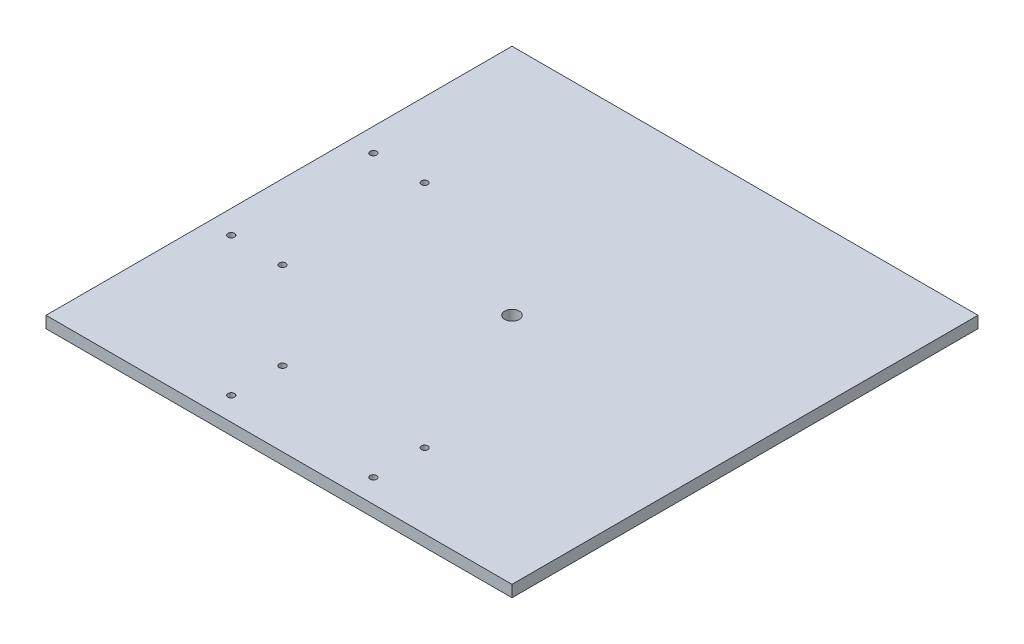
ISO-10303-21;
HEADER;
FILE_DESCRIPTION(('STEP AP214'),'2;1');
FILE_NAME('part.step','',(''),(''),'','','');
FILE_SCHEMA(('AUTOMOTIVE_DESIGN { 1 0 10303 214 1 1 1 1 }'));
ENDSEC;
DATA;
#1=APPLICATION_CONTEXT('core data for automotive mechanical design processes');
#2=APPLICATION_PROTOCOL_DEFINITION('international standard','automotive_design',2000,#1);
#3=PRODUCT_CONTEXT('',#1,'mechanical');
#4=PRODUCT('Part','Part','',(#3));
#5=PRODUCT_RELATED_PRODUCT_CATEGORY('part','',(#4));
#6=PRODUCT_DEFINITION_FORMATION('','',#4);
#7=PRODUCT_DEFINITION_CONTEXT('part definition',#1,'design');
#8=PRODUCT_DEFINITION('design','',#6,#7);
#9=PRODUCT_DEFINITION_SHAPE('','',#8);
#10=(LENGTH_UNIT() NAMED_UNIT(*) SI_UNIT(.MILLI.,.METRE.));
#11=(NAMED_UNIT(*) PLANE_ANGLE_UNIT() SI_UNIT($,.RADIAN.));
#12=(NAMED_UNIT(*) SI_UNIT($,.STERADIAN.) SOLID_ANGLE_UNIT());
#13=UNCERTAINTY_MEASURE_WITH_UNIT(LENGTH_MEASURE(1.E-05),#10,'distance_accuracy_value','');
#14=(GEOMETRIC_REPRESENTATION_CONTEXT(3) GLOBAL_UNCERTAINTY_ASSIGNED_CONTEXT((#13)) GLOBAL_UNIT_ASSIGNED_CONTEXT((#10,
#11,#12)) REPRESENTATION_CONTEXT('',''));
#15=CARTESIAN_POINT('',(0.,0.,0.));
#16=DIRECTION('',(0.,0.,1.));
#17=DIRECTION('',(1.,0.,0.));
#18=AXIS2_PLACEMENT_3D('',#15,#16,#17);
#19=CARTESIAN_POINT('',(0.,12.7,0.));
#20=DIRECTION('',(0.,-1.,0.));
#21=DIRECTION('',(0.,0.,-1.));
#22=AXIS2_PLACEMENT_3D('',#19,#20,#21);
#23=PLANE('',#22);
#24=CARTESIAN_POINT('',(0.,12.7,0.));
#25=DIRECTION('',(0.,1.,0.));
#26=DIRECTION('',(0.,0.,1.));
#27=AXIS2_PLACEMENT_3D('',#24,#25,#26);
#28=CIRCLE('',#27,7.9375);
#29=CARTESIAN_POINT('',(0.,12.7,7.9375));
#30=VERTEX_POINT('',#29);
#31=EDGE_CURVE('E160',#30,#30,#28,.T.);
#32=ORIENTED_EDGE('',*,*,#31,.F.);
#33=EDGE_LOOP('',(#32));
#34=FACE_BOUND('',#33,.T.);
#35=CARTESIAN_POINT('',(-77.47,12.7,228.6));
#36=DIRECTION('',(0.,1.,0.));
#37=DIRECTION('',(0.,0.,1.));
#38=AXIS2_PLACEMENT_3D('',#35,#36,#37);
#39=CIRCLE('',#38,3.56869999999998);
#40=CARTESIAN_POINT('',(-77.47,12.7,232.1687));
#41=VERTEX_POINT('',#40);
#42=EDGE_CURVE('E154',#41,#41,#39,.T.);
#43=ORIENTED_EDGE('',*,*,#42,.F.);
#44=EDGE_LOOP('',(#43));
#45=FACE_BOUND('',#44,.T.);
#46=CARTESIAN_POINT('',(-77.47,12.7,172.72));
#47=DIRECTION('',(0.,1.,0.));
#48=DIRECTION('',(0.,0.,1.));
#49=AXIS2_PLACEMENT_3D('',#46,#47,#48);
#50=CIRCLE('',#49,3.56869999999998);
#51=CARTESIAN_POINT('',(-77.47,12.7,176.2887));
#52=VERTEX_POINT('',#51);
#53=EDGE_CURVE('E148',#52,#52,#50,.T.);
#54=ORIENTED_EDGE('',*,*,#53,.F.);
#55=EDGE_LOOP('',(#54));
#56=FACE_BOUND('',#55,.T.);
#57=CARTESIAN_POINT('',(77.47,12.7,172.72));
#58=DIRECTION('',(0.,1.,0.));
#59=DIRECTION('',(0.,0.,1.));
#60=AXIS2_PLACEMENT_3D('',#57,#58,#59);
#61=CIRCLE('',#60,3.56869999999998);
#62=CARTESIAN_POINT('',(77.47,12.7,176.2887));
#63=VERTEX_POINT('',#62);
#64=EDGE_CURVE('E142',#63,#63,#61,.T.);
#65=ORIENTED_EDGE('',*,*,#64,.F.);
#66=EDGE_LOOP('',(#65));
#67=FACE_BOUND('',#66,.T.);
#68=CARTESIAN_POINT('',(-172.72,12.7,-77.47));
#69=DIRECTION('',(0.,1.,0.));
#70=DIRECTION('',(0.,0.,1.));
#71=AXIS2_PLACEMENT_3D('',#68,#69,#70);
#72=CIRCLE('',#71,3.56869999999998);
#73=CARTESIAN_POINT('',(-172.72,12.7,-73.9013));
#74=VERTEX_POINT('',#73);
#75=EDGE_CURVE('E118',#74,#74,#72,.T.);
#76=ORIENTED_EDGE('',*,*,#75,.F.);
#77=EDGE_LOOP('',(#76));
#78=FACE_BOUND('',#77,.T.);
#79=CARTESIAN_POINT('',(-228.6,12.7,-77.47));
#80=DIRECTION('',(0.,1.,0.));
#81=DIRECTION('',(0.,0.,1.));
#82=AXIS2_PLACEMENT_3D('',#79,#80,#81);
#83=CIRCLE('',#82,3.56869999999998);
#84=CARTESIAN_POINT('',(-228.6,12.7,-73.9013));
#85=VERTEX_POINT('',#84);
#86=EDGE_CURVE('E112',#85,#85,#83,.T.);
#87=ORIENTED_EDGE('',*,*,#86,.F.);
#88=EDGE_LOOP('',(#87));
#89=FACE_BOUND('',#88,.T.);
#90=DIRECTION('',(0.,0.,-1.));
#91=VECTOR('',#90,1.);
#92=CARTESIAN_POINT('',(254.,12.7,254.));
#93=LINE('',#92,#91);
#94=CARTESIAN_POINT('',(254.,12.7,254.));
#95=VERTEX_POINT('',#94);
#96=CARTESIAN_POINT('',(254.,12.7,-254.));
#97=VERTEX_POINT('',#96);
#98=EDGE_CURVE('E84',#95,#97,#93,.T.);
#99=ORIENTED_EDGE('',*,*,#98,.T.);
#100=DIRECTION('',(-1.,0.,0.));
#101=VECTOR('',#100,1.);
#102=CARTESIAN_POINT('',(-254.,12.7,-254.));
#103=LINE('',#102,#101);
#104=CARTESIAN_POINT('',(-254.,12.7,-254.));
#105=VERTEX_POINT('',#104);
#106=EDGE_CURVE('E79',#97,#105,#103,.T.);
#107=ORIENTED_EDGE('',*,*,#106,.T.);
#108=DIRECTION('',(0.,0.,1.));
#109=VECTOR('',#108,1.);
#110=CARTESIAN_POINT('',(-254.,12.7,254.));
#111=LINE('',#110,#109);
#112=CARTESIAN_POINT('',(-254.,12.7,254.));
#113=VERTEX_POINT('',#112);
#114=EDGE_CURVE('E82',#105,#113,#111,.T.);
#115=ORIENTED_EDGE('',*,*,#114,.T.);
#116=DIRECTION('',(1.,0.,0.));
#117=VECTOR('',#116,1.);
#118=CARTESIAN_POINT('',(-254.,12.7,254.));
#119=LINE('',#118,#117);
#120=EDGE_CURVE('E49',#113,#95,#119,.T.);
#121=ORIENTED_EDGE('',*,*,#120,.T.);
#122=EDGE_LOOP('',(#99,#107,#115,#121));
#123=FACE_BOUND('',#122,.T.);
#124=CARTESIAN_POINT('',(-172.72,12.7,77.47));
#125=DIRECTION('',(0.,1.,0.));
#126=DIRECTION('',(0.,0.,1.));
#127=AXIS2_PLACEMENT_3D('',#124,#125,#126);
#128=CIRCLE('',#127,3.56869999999998);
#129=CARTESIAN_POINT('',(-172.72,12.7,81.0387));
#130=VERTEX_POINT('',#129);
#131=EDGE_CURVE('E124',#130,#130,#128,.T.);
#132=ORIENTED_EDGE('',*,*,#131,.F.);
#133=EDGE_LOOP('',(#132));
#134=FACE_BOUND('',#133,.T.);
#135=CARTESIAN_POINT('',(-228.6,12.7,77.47));
#136=DIRECTION('',(0.,1.,0.));
#137=DIRECTION('',(0.,0.,1.));
#138=AXIS2_PLACEMENT_3D('',#135,#136,#137);
#139=CIRCLE('',#138,3.56869999999998);
#140=CARTESIAN_POINT('',(-228.6,12.7,81.0387));
#141=VERTEX_POINT('',#140);
#142=EDGE_CURVE('E130',#141,#141,#139,.T.);
#143=ORIENTED_EDGE('',*,*,#142,.F.);
#144=EDGE_LOOP('',(#143));
#145=FACE_BOUND('',#144,.T.);
#146=CARTESIAN_POINT('',(77.47,12.7,228.6));
#147=DIRECTION('',(0.,1.,0.));
#148=DIRECTION('',(0.,0.,1.));
#149=AXIS2_PLACEMENT_3D('',#146,#147,#148);
#150=CIRCLE('',#149,3.56869999999998);
#151=CARTESIAN_POINT('',(77.47,12.7,232.1687));
#152=VERTEX_POINT('',#151);
#153=EDGE_CURVE('E136',#152,#152,#150,.T.);
#154=ORIENTED_EDGE('',*,*,#153,.F.);
#155=EDGE_LOOP('',(#154));
#156=FACE_BOUND('',#155,.T.);
#157=ADVANCED_FACE('F32',(#34,#45,#56,#67,#78,#89,#123,#134,#145,#156),#23,.F.);
#158=CARTESIAN_POINT('',(254.,12.7,254.));
#159=DIRECTION('',(-1.,0.,0.));
#160=DIRECTION('',(0.,0.,1.));
#161=AXIS2_PLACEMENT_3D('',#158,#159,#160);
#162=PLANE('',#161);
#163=DIRECTION('',(0.,0.,-1.));
#164=VECTOR('',#163,1.);
#165=CARTESIAN_POINT('',(254.,0.,254.));
#166=LINE('',#165,#164);
#167=CARTESIAN_POINT('',(254.,0.,254.));
#168=VERTEX_POINT('',#167);
#169=CARTESIAN_POINT('',(254.,0.,-254.));
#170=VERTEX_POINT('',#169);
#171=EDGE_CURVE('E96',#168,#170,#166,.T.);
#172=ORIENTED_EDGE('',*,*,#171,.T.);
#173=DIRECTION('',(0.,-1.,0.));
#174=VECTOR('',#173,1.);
#175=CARTESIAN_POINT('',(254.,12.7,-254.));
#176=LINE('',#175,#174);
#177=EDGE_CURVE('E11',#97,#170,#176,.T.);
#178=ORIENTED_EDGE('',*,*,#177,.F.);
#179=ORIENTED_EDGE('',*,*,#98,.F.);
#180=DIRECTION('',(0.,-1.,0.));
#181=VECTOR('',#180,1.);
#182=CARTESIAN_POINT('',(254.,12.7,254.));
#183=LINE('',#182,#181);
#184=EDGE_CURVE('E92',#95,#168,#183,.T.);
#185=ORIENTED_EDGE('',*,*,#184,.T.);
#186=EDGE_LOOP('',(#172,#178,#179,#185));
#187=FACE_BOUND('',#186,.T.);
#188=ADVANCED_FACE('F34',(#187),#162,.F.);
#189=CARTESIAN_POINT('',(-254.,12.7,-254.));
#190=DIRECTION('',(0.,0.,1.));
#191=DIRECTION('',(1.,0.,0.));
#192=AXIS2_PLACEMENT_3D('',#189,#190,#191);
#193=PLANE('',#192);
#194=DIRECTION('',(-1.,0.,0.));
#195=VECTOR('',#194,1.);
#196=CARTESIAN_POINT('',(-254.,0.,-254.));
#197=LINE('',#196,#195);
#198=CARTESIAN_POINT('',(-254.,0.,-254.));
#199=VERTEX_POINT('',#198);
#200=EDGE_CURVE('E88',#170,#199,#197,.T.);
#201=ORIENTED_EDGE('',*,*,#200,.T.);
#202=DIRECTION('',(0.,-1.,0.));
#203=VECTOR('',#202,1.);
#204=CARTESIAN_POINT('',(-254.,12.7,-254.));
#205=LINE('',#204,#203);
#206=EDGE_CURVE('E41',#105,#199,#205,.T.);
#207=ORIENTED_EDGE('',*,*,#206,.F.);
#208=ORIENTED_EDGE('',*,*,#106,.F.);
#209=ORIENTED_EDGE('',*,*,#177,.T.);
#210=EDGE_LOOP('',(#201,#207,#208,#209));
#211=FACE_BOUND('',#210,.T.);
#212=ADVANCED_FACE('F87',(#211),#193,.F.);
#213=CARTESIAN_POINT('',(-254.,12.7,254.));
#214=DIRECTION('',(1.,0.,0.));
#215=DIRECTION('',(0.,0.,-1.));
#216=AXIS2_PLACEMENT_3D('',#213,#214,#215);
#217=PLANE('',#216);
#218=DIRECTION('',(0.,0.,1.));
#219=VECTOR('',#218,1.);
#220=CARTESIAN_POINT('',(-254.,0.,254.));
#221=LINE('',#220,#219);
#222=CARTESIAN_POINT('',(-254.,0.,254.));
#223=VERTEX_POINT('',#222);
#224=EDGE_CURVE('E66',#199,#223,#221,.T.);
#225=ORIENTED_EDGE('',*,*,#224,.T.);
#226=DIRECTION('',(0.,-1.,0.));
#227=VECTOR('',#226,1.);
#228=CARTESIAN_POINT('',(-254.,12.7,254.));
#229=LINE('',#228,#227);
#230=EDGE_CURVE('E89',#113,#223,#229,.T.);
#231=ORIENTED_EDGE('',*,*,#230,.F.);
#232=ORIENTED_EDGE('',*,*,#114,.F.);
#233=ORIENTED_EDGE('',*,*,#206,.T.);
#234=EDGE_LOOP('',(#225,#231,#232,#233));
#235=FACE_BOUND('',#234,.T.);
#236=ADVANCED_FACE('F90',(#235),#217,.F.);
#237=CARTESIAN_POINT('',(-254.,12.7,254.));
#238=DIRECTION('',(0.,0.,-1.));
#239=DIRECTION('',(-1.,0.,0.));
#240=AXIS2_PLACEMENT_3D('',#237,#238,#239);
#241=PLANE('',#240);
#242=DIRECTION('',(1.,0.,0.));
#243=VECTOR('',#242,1.);
#244=CARTESIAN_POINT('',(-254.,0.,254.));
#245=LINE('',#244,#243);
#246=EDGE_CURVE('E72',#223,#168,#245,.T.);
#247=ORIENTED_EDGE('',*,*,#246,.T.);
#248=ORIENTED_EDGE('',*,*,#184,.F.);
#249=ORIENTED_EDGE('',*,*,#120,.F.);
#250=ORIENTED_EDGE('',*,*,#230,.T.);
#251=EDGE_LOOP('',(#247,#248,#249,#250));
#252=FACE_BOUND('',#251,.T.);
#253=ADVANCED_FACE('F104',(#252),#241,.F.);
#254=CARTESIAN_POINT('',(0.,0.,0.));
#255=DIRECTION('',(0.,-1.,0.));
#256=DIRECTION('',(0.,0.,-1.));
#257=AXIS2_PLACEMENT_3D('',#254,#255,#256);
#258=PLANE('',#257);
#259=CARTESIAN_POINT('',(0.,0.,0.));
#260=DIRECTION('',(0.,-1.,0.));
#261=DIRECTION('',(0.,0.,-1.));
#262=AXIS2_PLACEMENT_3D('',#259,#260,#261);
#263=CIRCLE('',#262,7.9375);
#264=CARTESIAN_POINT('',(0.,0.,-7.9375));
#265=VERTEX_POINT('',#264);
#266=EDGE_CURVE('E157',#265,#265,#263,.T.);
#267=ORIENTED_EDGE('',*,*,#266,.F.);
#268=EDGE_LOOP('',(#267));
#269=FACE_BOUND('',#268,.T.);
#270=CARTESIAN_POINT('',(-77.47,0.,228.6));
#271=DIRECTION('',(0.,-1.,0.));
#272=DIRECTION('',(0.,0.,-1.));
#273=AXIS2_PLACEMENT_3D('',#270,#271,#272);
#274=CIRCLE('',#273,3.56869999999999);
#275=CARTESIAN_POINT('',(-77.47,0.,225.0313));
#276=VERTEX_POINT('',#275);
#277=EDGE_CURVE('E151',#276,#276,#274,.T.);
#278=ORIENTED_EDGE('',*,*,#277,.F.);
#279=EDGE_LOOP('',(#278));
#280=FACE_BOUND('',#279,.T.);
#281=CARTESIAN_POINT('',(-77.47,0.,172.72));
#282=DIRECTION('',(0.,-1.,0.));
#283=DIRECTION('',(0.,0.,-1.));
#284=AXIS2_PLACEMENT_3D('',#281,#282,#283);
#285=CIRCLE('',#284,3.56869999999999);
#286=CARTESIAN_POINT('',(-77.47,0.,169.1513));
#287=VERTEX_POINT('',#286);
#288=EDGE_CURVE('E145',#287,#287,#285,.T.);
#289=ORIENTED_EDGE('',*,*,#288,.F.);
#290=EDGE_LOOP('',(#289));
#291=FACE_BOUND('',#290,.T.);
#292=CARTESIAN_POINT('',(77.47,0.,172.72));
#293=DIRECTION('',(0.,-1.,0.));
#294=DIRECTION('',(0.,0.,-1.));
#295=AXIS2_PLACEMENT_3D('',#292,#293,#294);
#296=CIRCLE('',#295,3.56869999999999);
#297=CARTESIAN_POINT('',(77.47,0.,169.1513));
#298=VERTEX_POINT('',#297);
#299=EDGE_CURVE('E139',#298,#298,#296,.T.);
#300=ORIENTED_EDGE('',*,*,#299,.F.);
#301=EDGE_LOOP('',(#300));
#302=FACE_BOUND('',#301,.T.);
#303=CARTESIAN_POINT('',(77.47,0.,228.6));
#304=DIRECTION('',(0.,-1.,0.));
#305=DIRECTION('',(0.,0.,-1.));
#306=AXIS2_PLACEMENT_3D('',#303,#304,#305);
#307=CIRCLE('',#306,3.56869999999999);
#308=CARTESIAN_POINT('',(77.47,0.,225.0313));
#309=VERTEX_POINT('',#308);
#310=EDGE_CURVE('E133',#309,#309,#307,.T.);
#311=ORIENTED_EDGE('',*,*,#310,.F.);
#312=EDGE_LOOP('',(#311));
#313=FACE_BOUND('',#312,.T.);
#314=CARTESIAN_POINT('',(-228.6,0.,77.47));
#315=DIRECTION('',(0.,-1.,0.));
#316=DIRECTION('',(0.,0.,-1.));
#317=AXIS2_PLACEMENT_3D('',#314,#315,#316);
#318=CIRCLE('',#317,3.56869999999999);
#319=CARTESIAN_POINT('',(-228.6,0.,73.9013));
#320=VERTEX_POINT('',#319);
#321=EDGE_CURVE('E127',#320,#320,#318,.T.);
#322=ORIENTED_EDGE('',*,*,#321,.F.);
#323=EDGE_LOOP('',(#322));
#324=FACE_BOUND('',#323,.T.);
#325=CARTESIAN_POINT('',(-172.72,0.,77.47));
#326=DIRECTION('',(0.,-1.,0.));
#327=DIRECTION('',(0.,0.,-1.));
#328=AXIS2_PLACEMENT_3D('',#325,#326,#327);
#329=CIRCLE('',#328,3.56869999999999);
#330=CARTESIAN_POINT('',(-172.72,0.,73.9013));
#331=VERTEX_POINT('',#330);
#332=EDGE_CURVE('E121',#331,#331,#329,.T.);
#333=ORIENTED_EDGE('',*,*,#332,.F.);
#334=EDGE_LOOP('',(#333));
#335=FACE_BOUND('',#334,.T.);
#336=CARTESIAN_POINT('',(-172.72,0.,-77.47));
#337=DIRECTION('',(0.,-1.,0.));
#338=DIRECTION('',(0.,0.,-1.));
#339=AXIS2_PLACEMENT_3D('',#336,#337,#338);
#340=CIRCLE('',#339,3.56869999999999);
#341=CARTESIAN_POINT('',(-172.72,0.,-81.0387));
#342=VERTEX_POINT('',#341);
#343=EDGE_CURVE('E115',#342,#342,#340,.T.);
#344=ORIENTED_EDGE('',*,*,#343,.F.);
#345=EDGE_LOOP('',(#344));
#346=FACE_BOUND('',#345,.T.);
#347=CARTESIAN_POINT('',(-228.6,0.,-77.47));
#348=DIRECTION('',(0.,-1.,0.));
#349=DIRECTION('',(0.,0.,-1.));
#350=AXIS2_PLACEMENT_3D('',#347,#348,#349);
#351=CIRCLE('',#350,3.56869999999999);
#352=CARTESIAN_POINT('',(-228.6,0.,-81.0387));
#353=VERTEX_POINT('',#352);
#354=EDGE_CURVE('E99',#353,#353,#351,.T.);
#355=ORIENTED_EDGE('',*,*,#354,.F.);
#356=EDGE_LOOP('',(#355));
#357=FACE_BOUND('',#356,.T.);
#358=ORIENTED_EDGE('',*,*,#171,.F.);
#359=ORIENTED_EDGE('',*,*,#246,.F.);
#360=ORIENTED_EDGE('',*,*,#224,.F.);
#361=ORIENTED_EDGE('',*,*,#200,.F.);
#362=EDGE_LOOP('',(#358,#359,#360,#361));
#363=FACE_BOUND('',#362,.T.);
#364=ADVANCED_FACE('F107',(#269,#280,#291,#302,#313,#324,#335,#346,#357,#363),#258,.T.);
#365=CARTESIAN_POINT('',(-228.6,12.7,-77.47));
#366=DIRECTION('',(0.,1.,0.));
#367=DIRECTION('',(0.,0.,1.));
#368=AXIS2_PLACEMENT_3D('',#365,#366,#367);
#369=CYLINDRICAL_SURFACE('',#368,3.56869999999999);
#370=ORIENTED_EDGE('',*,*,#86,.T.);
#371=EDGE_LOOP('',(#370));
#372=FACE_BOUND('',#371,.T.);
#373=ORIENTED_EDGE('',*,*,#354,.T.);
#374=EDGE_LOOP('',(#373));
#375=FACE_BOUND('',#374,.T.);
#376=ADVANCED_FACE('F179',(#372,#375),#369,.F.);
#377=CARTESIAN_POINT('',(-172.72,12.7,-77.47));
#378=DIRECTION('',(0.,1.,0.));
#379=DIRECTION('',(0.,0.,1.));
#380=AXIS2_PLACEMENT_3D('',#377,#378,#379);
#381=CYLINDRICAL_SURFACE('',#380,3.56869999999999);
#382=ORIENTED_EDGE('',*,*,#75,.T.);
#383=EDGE_LOOP('',(#382));
#384=FACE_BOUND('',#383,.T.);
#385=ORIENTED_EDGE('',*,*,#343,.T.);
#386=EDGE_LOOP('',(#385));
#387=FACE_BOUND('',#386,.T.);
#388=ADVANCED_FACE('F182',(#384,#387),#381,.F.);
#389=CARTESIAN_POINT('',(-172.72,12.7,77.47));
#390=DIRECTION('',(0.,1.,0.));
#391=DIRECTION('',(0.,0.,1.));
#392=AXIS2_PLACEMENT_3D('',#389,#390,#391);
#393=CYLINDRICAL_SURFACE('',#392,3.56869999999999);
#394=ORIENTED_EDGE('',*,*,#131,.T.);
#395=EDGE_LOOP('',(#394));
#396=FACE_BOUND('',#395,.T.);
#397=ORIENTED_EDGE('',*,*,#332,.T.);
#398=EDGE_LOOP('',(#397));
#399=FACE_BOUND('',#398,.T.);
#400=ADVANCED_FACE('F238',(#396,#399),#393,.F.);
#401=CARTESIAN_POINT('',(-228.6,12.7,77.47));
#402=DIRECTION('',(0.,1.,0.));
#403=DIRECTION('',(0.,0.,1.));
#404=AXIS2_PLACEMENT_3D('',#401,#402,#403);
#405=CYLINDRICAL_SURFACE('',#404,3.56869999999999);
#406=ORIENTED_EDGE('',*,*,#142,.T.);
#407=EDGE_LOOP('',(#406));
#408=FACE_BOUND('',#407,.T.);
#409=ORIENTED_EDGE('',*,*,#321,.T.);
#410=EDGE_LOOP('',(#409));
#411=FACE_BOUND('',#410,.T.);
#412=ADVANCED_FACE('F248',(#408,#411),#405,.F.);
#413=CARTESIAN_POINT('',(77.47,12.7,228.6));
#414=DIRECTION('',(0.,1.,0.));
#415=DIRECTION('',(0.,0.,1.));
#416=AXIS2_PLACEMENT_3D('',#413,#414,#415);
#417=CYLINDRICAL_SURFACE('',#416,3.56869999999999);
#418=ORIENTED_EDGE('',*,*,#153,.T.);
#419=EDGE_LOOP('',(#418));
#420=FACE_BOUND('',#419,.T.);
#421=ORIENTED_EDGE('',*,*,#310,.T.);
#422=EDGE_LOOP('',(#421));
#423=FACE_BOUND('',#422,.T.);
#424=ADVANCED_FACE('F258',(#420,#423),#417,.F.);
#425=CARTESIAN_POINT('',(77.47,12.7,172.72));
#426=DIRECTION('',(0.,1.,0.));
#427=DIRECTION('',(0.,0.,1.));
#428=AXIS2_PLACEMENT_3D('',#425,#426,#427);
#429=CYLINDRICAL_SURFACE('',#428,3.56869999999999);
#430=ORIENTED_EDGE('',*,*,#64,.T.);
#431=EDGE_LOOP('',(#430));
#432=FACE_BOUND('',#431,.T.);
#433=ORIENTED_EDGE('',*,*,#299,.T.);
#434=EDGE_LOOP('',(#433));
#435=FACE_BOUND('',#434,.T.);
#436=ADVANCED_FACE('F268',(#432,#435),#429,.F.);
#437=CARTESIAN_POINT('',(-77.47,12.7,172.72));
#438=DIRECTION('',(0.,1.,0.));
#439=DIRECTION('',(0.,0.,1.));
#440=AXIS2_PLACEMENT_3D('',#437,#438,#439);
#441=CYLINDRICAL_SURFACE('',#440,3.56869999999999);
#442=ORIENTED_EDGE('',*,*,#53,.T.);
#443=EDGE_LOOP('',(#442));
#444=FACE_BOUND('',#443,.T.);
#445=ORIENTED_EDGE('',*,*,#288,.T.);
#446=EDGE_LOOP('',(#445));
#447=FACE_BOUND('',#446,.T.);
#448=ADVANCED_FACE('F278',(#444,#447),#441,.F.);
#449=CARTESIAN_POINT('',(-77.47,12.7,228.6));
#450=DIRECTION('',(0.,1.,0.));
#451=DIRECTION('',(0.,0.,1.));
#452=AXIS2_PLACEMENT_3D('',#449,#450,#451);
#453=CYLINDRICAL_SURFACE('',#452,3.56869999999999);
#454=ORIENTED_EDGE('',*,*,#42,.T.);
#455=EDGE_LOOP('',(#454));
#456=FACE_BOUND('',#455,.T.);
#457=ORIENTED_EDGE('',*,*,#277,.T.);
#458=EDGE_LOOP('',(#457));
#459=FACE_BOUND('',#458,.T.);
#460=ADVANCED_FACE('F288',(#456,#459),#453,.F.);
#461=CARTESIAN_POINT('',(0.,12.7,0.));
#462=DIRECTION('',(0.,1.,0.));
#463=DIRECTION('',(0.,0.,1.));
#464=AXIS2_PLACEMENT_3D('',#461,#462,#463);
#465=CYLINDRICAL_SURFACE('',#464,7.9375);
#466=ORIENTED_EDGE('',*,*,#266,.T.);
#467=EDGE_LOOP('',(#466));
#468=FACE_BOUND('',#467,.T.);
#469=ORIENTED_EDGE('',*,*,#31,.T.);
#470=EDGE_LOOP('',(#469));
#471=FACE_BOUND('',#470,.T.);
#472=ADVANCED_FACE('F164',(#468,#471),#465,.F.);
#473=CLOSED_SHELL('',(#157,#188,#212,#236,#253,#364,#376,#388,#400,#412,#424,#436,#448,#460,#472));
#474=MANIFOLD_SOLID_BREP('B2',#473);
#475=ADVANCED_BREP_SHAPE_REPRESENTATION('',(#18,#474),#14);
#476=SHAPE_DEFINITION_REPRESENTATION(#9,#475);
ENDSEC;
END-ISO-10303-21;
